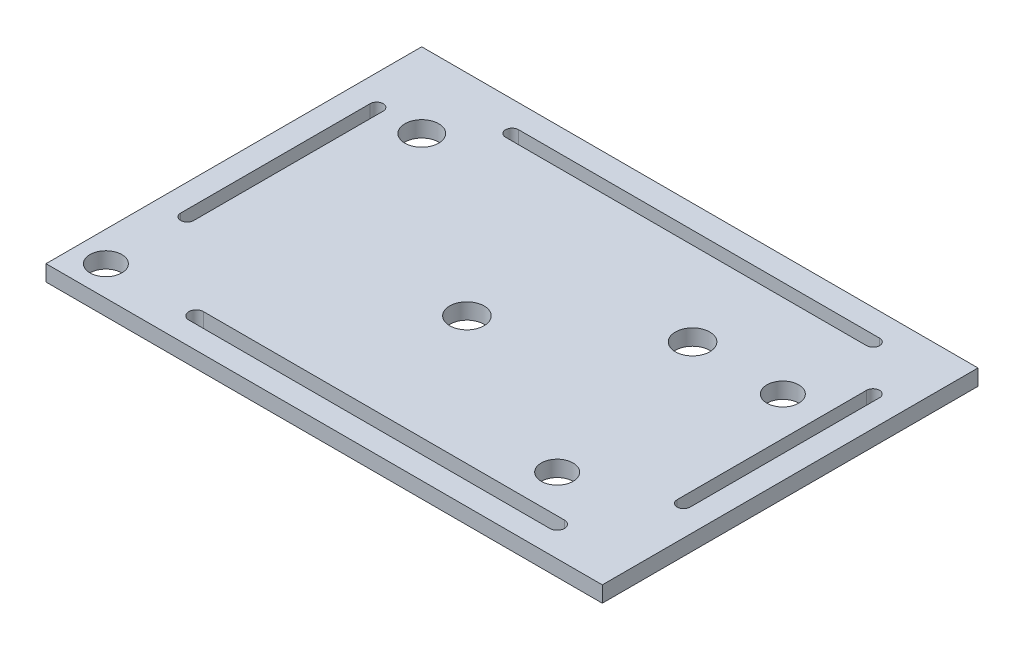
ISO-10303-21;
HEADER;
FILE_DESCRIPTION(('STEP AP214'),'2;1');
FILE_NAME('part.step','',(''),(''),'','','');
FILE_SCHEMA(('AUTOMOTIVE_DESIGN { 1 0 10303 214 1 1 1 1 }'));
ENDSEC;
DATA;
#1=APPLICATION_CONTEXT('core data for automotive mechanical design processes');
#2=APPLICATION_PROTOCOL_DEFINITION('international standard','automotive_design',2000,#1);
#3=PRODUCT_CONTEXT('',#1,'mechanical');
#4=PRODUCT('Part','Part','',(#3));
#5=PRODUCT_RELATED_PRODUCT_CATEGORY('part','',(#4));
#6=PRODUCT_DEFINITION_FORMATION('','',#4);
#7=PRODUCT_DEFINITION_CONTEXT('part definition',#1,'design');
#8=PRODUCT_DEFINITION('design','',#6,#7);
#9=PRODUCT_DEFINITION_SHAPE('','',#8);
#10=(LENGTH_UNIT() NAMED_UNIT(*) SI_UNIT(.MILLI.,.METRE.));
#11=(NAMED_UNIT(*) PLANE_ANGLE_UNIT() SI_UNIT($,.RADIAN.));
#12=(NAMED_UNIT(*) SI_UNIT($,.STERADIAN.) SOLID_ANGLE_UNIT());
#13=UNCERTAINTY_MEASURE_WITH_UNIT(LENGTH_MEASURE(1.E-05),#10,'distance_accuracy_value','');
#14=(GEOMETRIC_REPRESENTATION_CONTEXT(3) GLOBAL_UNCERTAINTY_ASSIGNED_CONTEXT((#13)) GLOBAL_UNIT_ASSIGNED_CONTEXT((#10,
#11,#12)) REPRESENTATION_CONTEXT('',''));
#15=CARTESIAN_POINT('',(0.,0.,0.));
#16=DIRECTION('',(0.,0.,1.));
#17=DIRECTION('',(1.,0.,0.));
#18=AXIS2_PLACEMENT_3D('',#15,#16,#17);
#19=CARTESIAN_POINT('',(-83.4547235584328,3.175,38.3581423669495));
#20=DIRECTION('',(1.,0.,0.));
#21=DIRECTION('',(0.,0.,-1.));
#22=AXIS2_PLACEMENT_3D('',#19,#20,#21);
#23=PLANE('',#22);
#24=DIRECTION('',(0.,0.,1.));
#25=VECTOR('',#24,1.);
#26=CARTESIAN_POINT('',(-83.4547235584328,0.,38.3581423669495));
#27=LINE('',#26,#25);
#28=CARTESIAN_POINT('',(-83.4547235584328,0.,-36.5609862748368));
#29=VERTEX_POINT('',#28);
#30=CARTESIAN_POINT('',(-83.4547235584328,0.,38.3581423669495));
#31=VERTEX_POINT('',#30);
#32=EDGE_CURVE('E362',#29,#31,#27,.T.);
#33=ORIENTED_EDGE('',*,*,#32,.T.);
#34=DIRECTION('',(0.,-1.,0.));
#35=VECTOR('',#34,1.);
#36=CARTESIAN_POINT('',(-83.4547235584328,3.175,38.3581423669495));
#37=LINE('',#36,#35);
#38=CARTESIAN_POINT('',(-83.4547235584328,3.175,38.3581423669495));
#39=VERTEX_POINT('',#38);
#40=EDGE_CURVE('E12',#39,#31,#37,.T.);
#41=ORIENTED_EDGE('',*,*,#40,.F.);
#42=DIRECTION('',(0.,0.,1.));
#43=VECTOR('',#42,1.);
#44=CARTESIAN_POINT('',(-83.4547235584328,3.175,38.3581423669495));
#45=LINE('',#44,#43);
#46=CARTESIAN_POINT('',(-83.4547235584328,3.175,-36.5609862748368));
#47=VERTEX_POINT('',#46);
#48=EDGE_CURVE('E365',#47,#39,#45,.T.);
#49=ORIENTED_EDGE('',*,*,#48,.F.);
#50=DIRECTION('',(0.,-1.,0.));
#51=VECTOR('',#50,1.);
#52=CARTESIAN_POINT('',(-83.4547235584328,3.175,-36.5609862748368));
#53=LINE('',#52,#51);
#54=EDGE_CURVE('E379',#47,#29,#53,.T.);
#55=ORIENTED_EDGE('',*,*,#54,.T.);
#56=EDGE_LOOP('',(#33,#41,#49,#55));
#57=FACE_BOUND('',#56,.T.);
#58=ADVANCED_FACE('F39',(#57),#23,.F.);
#59=CARTESIAN_POINT('',(27.4816050833534,3.175,38.3581423669495));
#60=DIRECTION('',(0.,0.,-1.));
#61=DIRECTION('',(-1.,0.,0.));
#62=AXIS2_PLACEMENT_3D('',#59,#60,#61);
#63=PLANE('',#62);
#64=DIRECTION('',(1.,0.,0.));
#65=VECTOR('',#64,1.);
#66=CARTESIAN_POINT('',(27.4816050833534,0.,38.3581423669495));
#67=LINE('',#66,#65);
#68=CARTESIAN_POINT('',(27.4816050833534,0.,38.3581423669495));
#69=VERTEX_POINT('',#68);
#70=EDGE_CURVE('E382',#31,#69,#67,.T.);
#71=ORIENTED_EDGE('',*,*,#70,.T.);
#72=DIRECTION('',(0.,-1.,0.));
#73=VECTOR('',#72,1.);
#74=CARTESIAN_POINT('',(27.4816050833534,3.175,38.3581423669495));
#75=LINE('',#74,#73);
#76=CARTESIAN_POINT('',(27.4816050833534,3.175,38.3581423669495));
#77=VERTEX_POINT('',#76);
#78=EDGE_CURVE('E46',#77,#69,#75,.T.);
#79=ORIENTED_EDGE('',*,*,#78,.F.);
#80=DIRECTION('',(1.,0.,0.));
#81=VECTOR('',#80,1.);
#82=CARTESIAN_POINT('',(27.4816050833534,3.175,38.3581423669495));
#83=LINE('',#82,#81);
#84=EDGE_CURVE('E369',#39,#77,#83,.T.);
#85=ORIENTED_EDGE('',*,*,#84,.F.);
#86=ORIENTED_EDGE('',*,*,#40,.T.);
#87=EDGE_LOOP('',(#71,#79,#85,#86));
#88=FACE_BOUND('',#87,.T.);
#89=ADVANCED_FACE('F411',(#88),#63,.F.);
#90=CARTESIAN_POINT('',(27.4816050833534,3.175,38.3581423669495));
#91=DIRECTION('',(-1.,0.,0.));
#92=DIRECTION('',(0.,0.,1.));
#93=AXIS2_PLACEMENT_3D('',#90,#91,#92);
#94=PLANE('',#93);
#95=DIRECTION('',(0.,0.,-1.));
#96=VECTOR('',#95,1.);
#97=CARTESIAN_POINT('',(27.4816050833534,0.,38.3581423669495));
#98=LINE('',#97,#96);
#99=CARTESIAN_POINT('',(27.4816050833534,0.,-36.5609862748368));
#100=VERTEX_POINT('',#99);
#101=EDGE_CURVE('E384',#69,#100,#98,.T.);
#102=ORIENTED_EDGE('',*,*,#101,.T.);
#103=DIRECTION('',(0.,-1.,0.));
#104=VECTOR('',#103,1.);
#105=CARTESIAN_POINT('',(27.4816050833534,3.175,-36.5609862748368));
#106=LINE('',#105,#104);
#107=CARTESIAN_POINT('',(27.4816050833534,3.175,-36.5609862748368));
#108=VERTEX_POINT('',#107);
#109=EDGE_CURVE('E389',#108,#100,#106,.T.);
#110=ORIENTED_EDGE('',*,*,#109,.F.);
#111=DIRECTION('',(0.,0.,-1.));
#112=VECTOR('',#111,1.);
#113=CARTESIAN_POINT('',(27.4816050833534,3.175,38.3581423669495));
#114=LINE('',#113,#112);
#115=EDGE_CURVE('E374',#77,#108,#114,.T.);
#116=ORIENTED_EDGE('',*,*,#115,.F.);
#117=ORIENTED_EDGE('',*,*,#78,.T.);
#118=EDGE_LOOP('',(#102,#110,#116,#117));
#119=FACE_BOUND('',#118,.T.);
#120=ADVANCED_FACE('F396',(#119),#94,.F.);
#121=CARTESIAN_POINT('',(27.4816050833534,3.175,-36.5609862748368));
#122=DIRECTION('',(0.,0.,1.));
#123=DIRECTION('',(1.,0.,0.));
#124=AXIS2_PLACEMENT_3D('',#121,#122,#123);
#125=PLANE('',#124);
#126=DIRECTION('',(-1.,0.,0.));
#127=VECTOR('',#126,1.);
#128=CARTESIAN_POINT('',(27.4816050833534,0.,-36.5609862748368));
#129=LINE('',#128,#127);
#130=EDGE_CURVE('E370',#100,#29,#129,.T.);
#131=ORIENTED_EDGE('',*,*,#130,.T.);
#132=ORIENTED_EDGE('',*,*,#54,.F.);
#133=DIRECTION('',(-1.,0.,0.));
#134=VECTOR('',#133,1.);
#135=CARTESIAN_POINT('',(27.4816050833534,3.175,-36.5609862748368));
#136=LINE('',#135,#134);
#137=EDGE_CURVE('E376',#108,#47,#136,.T.);
#138=ORIENTED_EDGE('',*,*,#137,.F.);
#139=ORIENTED_EDGE('',*,*,#109,.T.);
#140=EDGE_LOOP('',(#131,#132,#138,#139));
#141=FACE_BOUND('',#140,.T.);
#142=ADVANCED_FACE('F404',(#141),#125,.F.);
#143=CARTESIAN_POINT('',(0.,3.175,0.));
#144=DIRECTION('',(0.,1.,0.));
#145=DIRECTION('',(0.,0.,1.));
#146=AXIS2_PLACEMENT_3D('',#143,#144,#145);
#147=PLANE('',#146);
#148=CARTESIAN_POINT('',(-68.4741592375397,3.175,-21.6007419539436));
#149=DIRECTION('',(0.,1.,0.));
#150=DIRECTION('',(0.,0.,1.));
#151=AXIS2_PLACEMENT_3D('',#148,#149,#150);
#152=CIRCLE('',#151,3.3700793035933);
#153=CARTESIAN_POINT('',(-68.4741592375397,3.175,-18.2306626503503));
#154=VERTEX_POINT('',#153);
#155=EDGE_CURVE('E516',#154,#154,#152,.T.);
#156=ORIENTED_EDGE('',*,*,#155,.F.);
#157=EDGE_LOOP('',(#156));
#158=FACE_BOUND('',#157,.T.);
#159=CARTESIAN_POINT('',(-32.4772792375397,3.175,5.39691804605634));
#160=DIRECTION('',(0.,1.,0.));
#161=DIRECTION('',(0.,0.,1.));
#162=AXIS2_PLACEMENT_3D('',#159,#160,#161);
#163=CIRCLE('',#162,3.429);
#164=CARTESIAN_POINT('',(-32.4772792375397,3.175,8.82591804605634));
#165=VERTEX_POINT('',#164);
#166=EDGE_CURVE('E521',#165,#165,#163,.T.);
#167=ORIENTED_EDGE('',*,*,#166,.F.);
#168=EDGE_LOOP('',(#167));
#169=FACE_BOUND('',#168,.T.);
#170=CARTESIAN_POINT('',(-5.47961923753969,3.175,-12.6015219539437));
#171=DIRECTION('',(0.,1.,0.));
#172=DIRECTION('',(0.,0.,1.));
#173=AXIS2_PLACEMENT_3D('',#170,#171,#172);
#174=CIRCLE('',#173,3.429);
#175=CARTESIAN_POINT('',(-5.47961923753969,3.175,-9.17252195394369));
#176=VERTEX_POINT('',#175);
#177=EDGE_CURVE('E202',#176,#176,#174,.T.);
#178=ORIENTED_EDGE('',*,*,#177,.F.);
#179=EDGE_LOOP('',(#178));
#180=FACE_BOUND('',#179,.T.);
#181=CARTESIAN_POINT('',(-77.4733792375397,3.175,16.175423663261));
#182=DIRECTION('',(0.,1.,0.));
#183=DIRECTION('',(0.,0.,1.));
#184=AXIS2_PLACEMENT_3D('',#181,#182,#183);
#185=CIRCLE('',#184,1.29706207329394);
#186=CARTESIAN_POINT('',(-78.7704413108336,3.175,16.175423663261));
#187=VERTEX_POINT('',#186);
#188=CARTESIAN_POINT('',(-76.1763171642457,3.175,16.175423663261));
#189=VERTEX_POINT('',#188);
#190=EDGE_CURVE('E53',#187,#189,#185,.T.);
#191=ORIENTED_EDGE('',*,*,#190,.F.);
#192=DIRECTION('',(0.,0.,1.));
#193=VECTOR('',#192,1.);
#194=CARTESIAN_POINT('',(-78.7704413108336,3.175,16.175423663261));
#195=LINE('',#194,#193);
#196=CARTESIAN_POINT('',(-78.7704413108337,3.175,-21.6007419539436));
#197=VERTEX_POINT('',#196);
#198=EDGE_CURVE('E196',#197,#187,#195,.T.);
#199=ORIENTED_EDGE('',*,*,#198,.F.);
#200=CARTESIAN_POINT('',(-77.4733792375397,3.175,-21.6007419539436));
#201=DIRECTION('',(0.,1.,0.));
#202=DIRECTION('',(0.,0.,1.));
#203=AXIS2_PLACEMENT_3D('',#200,#201,#202);
#204=CIRCLE('',#203,1.29706207329394);
#205=CARTESIAN_POINT('',(-76.1763171642458,3.175,-21.6007419539436));
#206=VERTEX_POINT('',#205);
#207=EDGE_CURVE('E199',#206,#197,#204,.T.);
#208=ORIENTED_EDGE('',*,*,#207,.F.);
#209=DIRECTION('',(0.,0.,-1.));
#210=VECTOR('',#209,1.);
#211=CARTESIAN_POINT('',(-76.1763171642457,3.175,16.175423663261));
#212=LINE('',#211,#210);
#213=EDGE_CURVE('E210',#189,#206,#212,.T.);
#214=ORIENTED_EDGE('',*,*,#213,.F.);
#215=EDGE_LOOP('',(#191,#199,#208,#214));
#216=FACE_BOUND('',#215,.T.);
#217=CARTESIAN_POINT('',(-59.4749392375397,3.175,-30.5999619539437));
#218=DIRECTION('',(0.,1.,0.));
#219=DIRECTION('',(0.,0.,1.));
#220=AXIS2_PLACEMENT_3D('',#217,#218,#219);
#221=CIRCLE('',#220,1.29938042392028);
#222=CARTESIAN_POINT('',(-59.4749392375397,3.175,-31.8993423778639));
#223=VERTEX_POINT('',#222);
#224=CARTESIAN_POINT('',(-59.4749392375397,3.175,-29.3005815300234));
#225=VERTEX_POINT('',#224);
#226=EDGE_CURVE('E61',#223,#225,#221,.T.);
#227=ORIENTED_EDGE('',*,*,#226,.F.);
#228=DIRECTION('',(-1.,0.,0.));
#229=VECTOR('',#228,1.);
#230=CARTESIAN_POINT('',(-59.4749392375397,3.175,-31.8993423778639));
#231=LINE('',#230,#229);
#232=CARTESIAN_POINT('',(12.5188207624603,3.175,-31.899342377864));
#233=VERTEX_POINT('',#232);
#234=EDGE_CURVE('E233',#233,#223,#231,.T.);
#235=ORIENTED_EDGE('',*,*,#234,.F.);
#236=CARTESIAN_POINT('',(12.5188207624603,3.175,-30.5999619539437));
#237=DIRECTION('',(0.,1.,0.));
#238=DIRECTION('',(0.,0.,1.));
#239=AXIS2_PLACEMENT_3D('',#236,#237,#238);
#240=CIRCLE('',#239,1.29938042392027);
#241=CARTESIAN_POINT('',(12.5188207624603,3.175,-29.3005815300234));
#242=VERTEX_POINT('',#241);
#243=EDGE_CURVE('E257',#242,#233,#240,.T.);
#244=ORIENTED_EDGE('',*,*,#243,.F.);
#245=DIRECTION('',(1.,0.,0.));
#246=VECTOR('',#245,1.);
#247=CARTESIAN_POINT('',(-59.4749392375397,3.175,-29.3005815300234));
#248=LINE('',#247,#246);
#249=EDGE_CURVE('E245',#225,#242,#248,.T.);
#250=ORIENTED_EDGE('',*,*,#249,.F.);
#251=EDGE_LOOP('',(#227,#235,#244,#250));
#252=FACE_BOUND('',#251,.T.);
#253=CARTESIAN_POINT('',(12.5188207624603,3.175,32.3945780460563));
#254=DIRECTION('',(0.,1.,0.));
#255=DIRECTION('',(0.,0.,1.));
#256=AXIS2_PLACEMENT_3D('',#253,#254,#255);
#257=CIRCLE('',#256,1.45796750771068);
#258=CARTESIAN_POINT('',(12.5188207624603,3.175,33.852545553767));
#259=VERTEX_POINT('',#258);
#260=CARTESIAN_POINT('',(12.5188207624603,3.175,30.9366105383456));
#261=VERTEX_POINT('',#260);
#262=EDGE_CURVE('E279',#259,#261,#257,.T.);
#263=ORIENTED_EDGE('',*,*,#262,.F.);
#264=DIRECTION('',(1.,0.,0.));
#265=VECTOR('',#264,1.);
#266=CARTESIAN_POINT('',(12.5188207624603,3.175,33.852545553767));
#267=LINE('',#266,#265);
#268=CARTESIAN_POINT('',(-59.4749392375397,3.175,33.852545553767));
#269=VERTEX_POINT('',#268);
#270=EDGE_CURVE('E269',#269,#259,#267,.T.);
#271=ORIENTED_EDGE('',*,*,#270,.F.);
#272=CARTESIAN_POINT('',(-59.4749392375397,3.175,32.3945780460564));
#273=DIRECTION('',(0.,1.,0.));
#274=DIRECTION('',(0.,0.,1.));
#275=AXIS2_PLACEMENT_3D('',#272,#273,#274);
#276=CIRCLE('',#275,1.45796750771068);
#277=CARTESIAN_POINT('',(-59.4749392375397,3.175,30.9366105383457));
#278=VERTEX_POINT('',#277);
#279=EDGE_CURVE('E294',#278,#269,#276,.T.);
#280=ORIENTED_EDGE('',*,*,#279,.F.);
#281=DIRECTION('',(-1.,0.,0.));
#282=VECTOR('',#281,1.);
#283=CARTESIAN_POINT('',(12.5188207624603,3.175,30.9366105383456));
#284=LINE('',#283,#282);
#285=EDGE_CURVE('E282',#261,#278,#284,.T.);
#286=ORIENTED_EDGE('',*,*,#285,.F.);
#287=EDGE_LOOP('',(#263,#271,#280,#286));
#288=FACE_BOUND('',#287,.T.);
#289=CARTESIAN_POINT('',(21.5180407624603,3.175,16.175423663261));
#290=DIRECTION('',(0.,1.,0.));
#291=DIRECTION('',(0.,0.,1.));
#292=AXIS2_PLACEMENT_3D('',#289,#290,#291);
#293=CIRCLE('',#292,1.29162681993463);
#294=CARTESIAN_POINT('',(20.2264139425257,3.175,16.175423663261));
#295=VERTEX_POINT('',#294);
#296=CARTESIAN_POINT('',(22.809667582395,3.175,16.175423663261));
#297=VERTEX_POINT('',#296);
#298=EDGE_CURVE('E317',#295,#297,#293,.T.);
#299=ORIENTED_EDGE('',*,*,#298,.F.);
#300=DIRECTION('',(0.,0.,1.));
#301=VECTOR('',#300,1.);
#302=CARTESIAN_POINT('',(20.2264139425257,3.175,16.175423663261));
#303=LINE('',#302,#301);
#304=CARTESIAN_POINT('',(20.2264139425257,3.175,-21.6007419539437));
#305=VERTEX_POINT('',#304);
#306=EDGE_CURVE('E307',#305,#295,#303,.T.);
#307=ORIENTED_EDGE('',*,*,#306,.F.);
#308=CARTESIAN_POINT('',(21.5180407624603,3.175,-21.6007419539437));
#309=DIRECTION('',(0.,1.,0.));
#310=DIRECTION('',(0.,0.,1.));
#311=AXIS2_PLACEMENT_3D('',#308,#309,#310);
#312=CIRCLE('',#311,1.29162681993463);
#313=CARTESIAN_POINT('',(22.8096675823949,3.175,-21.6007419539437));
#314=VERTEX_POINT('',#313);
#315=EDGE_CURVE('E332',#314,#305,#312,.T.);
#316=ORIENTED_EDGE('',*,*,#315,.F.);
#317=DIRECTION('',(0.,0.,-1.));
#318=VECTOR('',#317,1.);
#319=CARTESIAN_POINT('',(22.809667582395,3.175,16.175423663261));
#320=LINE('',#319,#318);
#321=EDGE_CURVE('E320',#297,#314,#320,.T.);
#322=ORIENTED_EDGE('',*,*,#321,.F.);
#323=EDGE_LOOP('',(#299,#307,#316,#322));
#324=FACE_BOUND('',#323,.T.);
#325=CARTESIAN_POINT('',(12.5188207624603,3.175,-12.6015219539437));
#326=DIRECTION('',(0.,1.,0.));
#327=DIRECTION('',(0.,0.,1.));
#328=AXIS2_PLACEMENT_3D('',#325,#326,#327);
#329=CIRCLE('',#328,3.175);
#330=CARTESIAN_POINT('',(12.5188207624603,3.175,-9.4265219539437));
#331=VERTEX_POINT('',#330);
#332=EDGE_CURVE('E345',#331,#331,#329,.T.);
#333=ORIENTED_EDGE('',*,*,#332,.F.);
#334=EDGE_LOOP('',(#333));
#335=FACE_BOUND('',#334,.T.);
#336=CARTESIAN_POINT('',(3.51960076246033,3.175,23.3953580460563));
#337=DIRECTION('',(0.,1.,0.));
#338=DIRECTION('',(0.,0.,1.));
#339=AXIS2_PLACEMENT_3D('',#336,#337,#338);
#340=CIRCLE('',#339,3.175);
#341=CARTESIAN_POINT('',(3.51960076246033,3.175,26.5703580460563));
#342=VERTEX_POINT('',#341);
#343=EDGE_CURVE('E225',#342,#342,#340,.T.);
#344=ORIENTED_EDGE('',*,*,#343,.F.);
#345=EDGE_LOOP('',(#344));
#346=FACE_BOUND('',#345,.T.);
#347=CARTESIAN_POINT('',(-77.4733792375397,3.175,32.3945780460563));
#348=DIRECTION('',(0.,-1.,0.));
#349=DIRECTION('',(0.,0.,-1.));
#350=AXIS2_PLACEMENT_3D('',#347,#348,#349);
#351=CIRCLE('',#350,3.175);
#352=CARTESIAN_POINT('',(-77.4733792375397,3.175,29.2195780460563));
#353=VERTEX_POINT('',#352);
#354=EDGE_CURVE('E358',#353,#353,#351,.T.);
#355=ORIENTED_EDGE('',*,*,#354,.T.);
#356=EDGE_LOOP('',(#355));
#357=FACE_BOUND('',#356,.T.);
#358=ORIENTED_EDGE('',*,*,#48,.T.);
#359=ORIENTED_EDGE('',*,*,#84,.T.);
#360=ORIENTED_EDGE('',*,*,#115,.T.);
#361=ORIENTED_EDGE('',*,*,#137,.T.);
#362=EDGE_LOOP('',(#358,#359,#360,#361));
#363=FACE_BOUND('',#362,.T.);
#364=ADVANCED_FACE('F410',(#158,#169,#180,#216,#252,#288,#324,#335,#346,#357,#363),#147,.T.);
#365=CARTESIAN_POINT('',(0.,0.,0.));
#366=DIRECTION('',(0.,1.,0.));
#367=DIRECTION('',(0.,0.,1.));
#368=AXIS2_PLACEMENT_3D('',#365,#366,#367);
#369=PLANE('',#368);
#370=CARTESIAN_POINT('',(-68.4741592375397,0.,-21.6007419539436));
#371=DIRECTION('',(0.,1.,0.));
#372=DIRECTION('',(0.,0.,1.));
#373=AXIS2_PLACEMENT_3D('',#370,#371,#372);
#374=CIRCLE('',#373,3.3700793035933);
#375=CARTESIAN_POINT('',(-68.4741592375397,0.,-18.2306626503503));
#376=VERTEX_POINT('',#375);
#377=EDGE_CURVE('E321',#376,#376,#374,.T.);
#378=ORIENTED_EDGE('',*,*,#377,.T.);
#379=EDGE_LOOP('',(#378));
#380=FACE_BOUND('',#379,.T.);
#381=CARTESIAN_POINT('',(-32.4772792375397,0.,5.39691804605634));
#382=DIRECTION('',(0.,1.,0.));
#383=DIRECTION('',(0.,0.,1.));
#384=AXIS2_PLACEMENT_3D('',#381,#382,#383);
#385=CIRCLE('',#384,3.429);
#386=CARTESIAN_POINT('',(-32.4772792375397,0.,8.82591804605634));
#387=VERTEX_POINT('',#386);
#388=EDGE_CURVE('E517',#387,#387,#385,.T.);
#389=ORIENTED_EDGE('',*,*,#388,.T.);
#390=EDGE_LOOP('',(#389));
#391=FACE_BOUND('',#390,.T.);
#392=CARTESIAN_POINT('',(-5.47961923753969,0.,-12.6015219539437));
#393=DIRECTION('',(0.,1.,0.));
#394=DIRECTION('',(0.,0.,1.));
#395=AXIS2_PLACEMENT_3D('',#392,#393,#394);
#396=CIRCLE('',#395,3.429);
#397=CARTESIAN_POINT('',(-5.47961923753969,0.,-9.17252195394369));
#398=VERTEX_POINT('',#397);
#399=EDGE_CURVE('E528',#398,#398,#396,.T.);
#400=ORIENTED_EDGE('',*,*,#399,.T.);
#401=EDGE_LOOP('',(#400));
#402=FACE_BOUND('',#401,.T.);
#403=DIRECTION('',(0.,0.,1.));
#404=VECTOR('',#403,1.);
#405=CARTESIAN_POINT('',(-78.7704413108336,0.,16.175423663261));
#406=LINE('',#405,#404);
#407=CARTESIAN_POINT('',(-78.7704413108337,0.,-21.6007419539436));
#408=VERTEX_POINT('',#407);
#409=CARTESIAN_POINT('',(-78.7704413108336,0.,16.175423663261));
#410=VERTEX_POINT('',#409);
#411=EDGE_CURVE('E183',#408,#410,#406,.T.);
#412=ORIENTED_EDGE('',*,*,#411,.T.);
#413=CARTESIAN_POINT('',(-77.4733792375397,0.,16.175423663261));
#414=DIRECTION('',(0.,1.,0.));
#415=DIRECTION('',(0.,0.,1.));
#416=AXIS2_PLACEMENT_3D('',#413,#414,#415);
#417=CIRCLE('',#416,1.29706207329394);
#418=CARTESIAN_POINT('',(-76.1763171642457,0.,16.175423663261));
#419=VERTEX_POINT('',#418);
#420=EDGE_CURVE('E177',#410,#419,#417,.T.);
#421=ORIENTED_EDGE('',*,*,#420,.T.);
#422=DIRECTION('',(0.,0.,-1.));
#423=VECTOR('',#422,1.);
#424=CARTESIAN_POINT('',(-76.1763171642457,0.,16.175423663261));
#425=LINE('',#424,#423);
#426=CARTESIAN_POINT('',(-76.1763171642458,0.,-21.6007419539436));
#427=VERTEX_POINT('',#426);
#428=EDGE_CURVE('E187',#419,#427,#425,.T.);
#429=ORIENTED_EDGE('',*,*,#428,.T.);
#430=CARTESIAN_POINT('',(-77.4733792375397,0.,-21.6007419539436));
#431=DIRECTION('',(0.,1.,0.));
#432=DIRECTION('',(0.,0.,1.));
#433=AXIS2_PLACEMENT_3D('',#430,#431,#432);
#434=CIRCLE('',#433,1.29706207329394);
#435=EDGE_CURVE('E191',#427,#408,#434,.T.);
#436=ORIENTED_EDGE('',*,*,#435,.T.);
#437=EDGE_LOOP('',(#412,#421,#429,#436));
#438=FACE_BOUND('',#437,.T.);
#439=DIRECTION('',(-1.,0.,0.));
#440=VECTOR('',#439,1.);
#441=CARTESIAN_POINT('',(-59.4749392375397,0.,-31.8993423778639));
#442=LINE('',#441,#440);
#443=CARTESIAN_POINT('',(12.5188207624603,0.,-31.899342377864));
#444=VERTEX_POINT('',#443);
#445=CARTESIAN_POINT('',(-59.4749392375397,0.,-31.8993423778639));
#446=VERTEX_POINT('',#445);
#447=EDGE_CURVE('E239',#444,#446,#442,.T.);
#448=ORIENTED_EDGE('',*,*,#447,.T.);
#449=CARTESIAN_POINT('',(-59.4749392375397,0.,-30.5999619539437));
#450=DIRECTION('',(0.,1.,0.));
#451=DIRECTION('',(0.,0.,1.));
#452=AXIS2_PLACEMENT_3D('',#449,#450,#451);
#453=CIRCLE('',#452,1.29938042392028);
#454=CARTESIAN_POINT('',(-59.4749392375397,0.,-29.3005815300234));
#455=VERTEX_POINT('',#454);
#456=EDGE_CURVE('E229',#446,#455,#453,.T.);
#457=ORIENTED_EDGE('',*,*,#456,.T.);
#458=DIRECTION('',(1.,0.,0.));
#459=VECTOR('',#458,1.);
#460=CARTESIAN_POINT('',(-59.4749392375397,0.,-29.3005815300234));
#461=LINE('',#460,#459);
#462=CARTESIAN_POINT('',(12.5188207624603,0.,-29.3005815300234));
#463=VERTEX_POINT('',#462);
#464=EDGE_CURVE('E232',#455,#463,#461,.T.);
#465=ORIENTED_EDGE('',*,*,#464,.T.);
#466=CARTESIAN_POINT('',(12.5188207624603,0.,-30.5999619539437));
#467=DIRECTION('',(0.,1.,0.));
#468=DIRECTION('',(0.,0.,1.));
#469=AXIS2_PLACEMENT_3D('',#466,#467,#468);
#470=CIRCLE('',#469,1.29938042392027);
#471=EDGE_CURVE('E236',#463,#444,#470,.T.);
#472=ORIENTED_EDGE('',*,*,#471,.T.);
#473=EDGE_LOOP('',(#448,#457,#465,#472));
#474=FACE_BOUND('',#473,.T.);
#475=DIRECTION('',(1.,0.,0.));
#476=VECTOR('',#475,1.);
#477=CARTESIAN_POINT('',(12.5188207624603,0.,33.852545553767));
#478=LINE('',#477,#476);
#479=CARTESIAN_POINT('',(-59.4749392375397,0.,33.852545553767));
#480=VERTEX_POINT('',#479);
#481=CARTESIAN_POINT('',(12.5188207624603,0.,33.852545553767));
#482=VERTEX_POINT('',#481);
#483=EDGE_CURVE('E275',#480,#482,#478,.T.);
#484=ORIENTED_EDGE('',*,*,#483,.T.);
#485=CARTESIAN_POINT('',(12.5188207624603,0.,32.3945780460563));
#486=DIRECTION('',(0.,1.,0.));
#487=DIRECTION('',(0.,0.,1.));
#488=AXIS2_PLACEMENT_3D('',#485,#486,#487);
#489=CIRCLE('',#488,1.45796750771068);
#490=CARTESIAN_POINT('',(12.5188207624603,0.,30.9366105383456));
#491=VERTEX_POINT('',#490);
#492=EDGE_CURVE('E265',#482,#491,#489,.T.);
#493=ORIENTED_EDGE('',*,*,#492,.T.);
#494=DIRECTION('',(-1.,0.,0.));
#495=VECTOR('',#494,1.);
#496=CARTESIAN_POINT('',(12.5188207624603,0.,30.9366105383456));
#497=LINE('',#496,#495);
#498=CARTESIAN_POINT('',(-59.4749392375397,0.,30.9366105383457));
#499=VERTEX_POINT('',#498);
#500=EDGE_CURVE('E268',#491,#499,#497,.T.);
#501=ORIENTED_EDGE('',*,*,#500,.T.);
#502=CARTESIAN_POINT('',(-59.4749392375397,0.,32.3945780460564));
#503=DIRECTION('',(0.,1.,0.));
#504=DIRECTION('',(0.,0.,1.));
#505=AXIS2_PLACEMENT_3D('',#502,#503,#504);
#506=CIRCLE('',#505,1.45796750771068);
#507=EDGE_CURVE('E272',#499,#480,#506,.T.);
#508=ORIENTED_EDGE('',*,*,#507,.T.);
#509=EDGE_LOOP('',(#484,#493,#501,#508));
#510=FACE_BOUND('',#509,.T.);
#511=DIRECTION('',(0.,0.,1.));
#512=VECTOR('',#511,1.);
#513=CARTESIAN_POINT('',(20.2264139425257,0.,16.175423663261));
#514=LINE('',#513,#512);
#515=CARTESIAN_POINT('',(20.2264139425257,0.,-21.6007419539437));
#516=VERTEX_POINT('',#515);
#517=CARTESIAN_POINT('',(20.2264139425257,0.,16.175423663261));
#518=VERTEX_POINT('',#517);
#519=EDGE_CURVE('E313',#516,#518,#514,.T.);
#520=ORIENTED_EDGE('',*,*,#519,.T.);
#521=CARTESIAN_POINT('',(21.5180407624603,0.,16.175423663261));
#522=DIRECTION('',(0.,1.,0.));
#523=DIRECTION('',(0.,0.,1.));
#524=AXIS2_PLACEMENT_3D('',#521,#522,#523);
#525=CIRCLE('',#524,1.29162681993463);
#526=CARTESIAN_POINT('',(22.809667582395,0.,16.175423663261));
#527=VERTEX_POINT('',#526);
#528=EDGE_CURVE('E303',#518,#527,#525,.T.);
#529=ORIENTED_EDGE('',*,*,#528,.T.);
#530=DIRECTION('',(0.,0.,-1.));
#531=VECTOR('',#530,1.);
#532=CARTESIAN_POINT('',(22.809667582395,0.,16.175423663261));
#533=LINE('',#532,#531);
#534=CARTESIAN_POINT('',(22.8096675823949,0.,-21.6007419539437));
#535=VERTEX_POINT('',#534);
#536=EDGE_CURVE('E306',#527,#535,#533,.T.);
#537=ORIENTED_EDGE('',*,*,#536,.T.);
#538=CARTESIAN_POINT('',(21.5180407624603,0.,-21.6007419539437));
#539=DIRECTION('',(0.,1.,0.));
#540=DIRECTION('',(0.,0.,1.));
#541=AXIS2_PLACEMENT_3D('',#538,#539,#540);
#542=CIRCLE('',#541,1.29162681993463);
#543=EDGE_CURVE('E310',#535,#516,#542,.T.);
#544=ORIENTED_EDGE('',*,*,#543,.T.);
#545=EDGE_LOOP('',(#520,#529,#537,#544));
#546=FACE_BOUND('',#545,.T.);
#547=CARTESIAN_POINT('',(12.5188207624603,0.,-12.6015219539437));
#548=DIRECTION('',(0.,1.,0.));
#549=DIRECTION('',(0.,0.,1.));
#550=AXIS2_PLACEMENT_3D('',#547,#548,#549);
#551=CIRCLE('',#550,3.175);
#552=CARTESIAN_POINT('',(12.5188207624603,0.,-9.4265219539437));
#553=VERTEX_POINT('',#552);
#554=EDGE_CURVE('E341',#553,#553,#551,.T.);
#555=ORIENTED_EDGE('',*,*,#554,.T.);
#556=EDGE_LOOP('',(#555));
#557=FACE_BOUND('',#556,.T.);
#558=CARTESIAN_POINT('',(3.51960076246033,0.,23.3953580460563));
#559=DIRECTION('',(0.,1.,0.));
#560=DIRECTION('',(0.,0.,1.));
#561=AXIS2_PLACEMENT_3D('',#558,#559,#560);
#562=CIRCLE('',#561,3.175);
#563=CARTESIAN_POINT('',(3.51960076246033,0.,26.5703580460563));
#564=VERTEX_POINT('',#563);
#565=EDGE_CURVE('E349',#564,#564,#562,.T.);
#566=ORIENTED_EDGE('',*,*,#565,.T.);
#567=EDGE_LOOP('',(#566));
#568=FACE_BOUND('',#567,.T.);
#569=CARTESIAN_POINT('',(-77.4733792375397,0.,32.3945780460563));
#570=DIRECTION('',(0.,-1.,0.));
#571=DIRECTION('',(0.,0.,-1.));
#572=AXIS2_PLACEMENT_3D('',#569,#570,#571);
#573=CIRCLE('',#572,3.175);
#574=CARTESIAN_POINT('',(-77.4733792375397,0.,29.2195780460563));
#575=VERTEX_POINT('',#574);
#576=EDGE_CURVE('E344',#575,#575,#573,.T.);
#577=ORIENTED_EDGE('',*,*,#576,.F.);
#578=EDGE_LOOP('',(#577));
#579=FACE_BOUND('',#578,.T.);
#580=ORIENTED_EDGE('',*,*,#32,.F.);
#581=ORIENTED_EDGE('',*,*,#130,.F.);
#582=ORIENTED_EDGE('',*,*,#101,.F.);
#583=ORIENTED_EDGE('',*,*,#70,.F.);
#584=EDGE_LOOP('',(#580,#581,#582,#583));
#585=FACE_BOUND('',#584,.T.);
#586=ADVANCED_FACE('F193',(#380,#391,#402,#438,#474,#510,#546,#557,#568,#579,#585),#369,.F.);
#587=CARTESIAN_POINT('',(-77.4733792375397,3.175,32.3945780460563));
#588=DIRECTION('',(0.,-1.,0.));
#589=DIRECTION('',(0.,0.,-1.));
#590=AXIS2_PLACEMENT_3D('',#587,#588,#589);
#591=CYLINDRICAL_SURFACE('',#590,3.175);
#592=ORIENTED_EDGE('',*,*,#354,.F.);
#593=EDGE_LOOP('',(#592));
#594=FACE_BOUND('',#593,.T.);
#595=ORIENTED_EDGE('',*,*,#576,.T.);
#596=EDGE_LOOP('',(#595));
#597=FACE_BOUND('',#596,.T.);
#598=ADVANCED_FACE('F423',(#594,#597),#591,.F.);
#599=CARTESIAN_POINT('',(3.51960076246033,0.,23.3953580460563));
#600=DIRECTION('',(0.,1.,0.));
#601=DIRECTION('',(0.,0.,1.));
#602=AXIS2_PLACEMENT_3D('',#599,#600,#601);
#603=CYLINDRICAL_SURFACE('',#602,3.175);
#604=ORIENTED_EDGE('',*,*,#565,.F.);
#605=EDGE_LOOP('',(#604));
#606=FACE_BOUND('',#605,.T.);
#607=ORIENTED_EDGE('',*,*,#343,.T.);
#608=EDGE_LOOP('',(#607));
#609=FACE_BOUND('',#608,.T.);
#610=ADVANCED_FACE('F430',(#606,#609),#603,.F.);
#611=CARTESIAN_POINT('',(12.5188207624603,0.,-12.6015219539437));
#612=DIRECTION('',(0.,1.,0.));
#613=DIRECTION('',(0.,0.,1.));
#614=AXIS2_PLACEMENT_3D('',#611,#612,#613);
#615=CYLINDRICAL_SURFACE('',#614,3.175);
#616=ORIENTED_EDGE('',*,*,#554,.F.);
#617=EDGE_LOOP('',(#616));
#618=FACE_BOUND('',#617,.T.);
#619=ORIENTED_EDGE('',*,*,#332,.T.);
#620=EDGE_LOOP('',(#619));
#621=FACE_BOUND('',#620,.T.);
#622=ADVANCED_FACE('F434',(#618,#621),#615,.F.);
#623=CARTESIAN_POINT('',(21.5180407624603,0.,16.175423663261));
#624=DIRECTION('',(0.,1.,0.));
#625=DIRECTION('',(0.,0.,1.));
#626=AXIS2_PLACEMENT_3D('',#623,#624,#625);
#627=CYLINDRICAL_SURFACE('',#626,1.29162681993463);
#628=ORIENTED_EDGE('',*,*,#298,.T.);
#629=DIRECTION('',(0.,1.,0.));
#630=VECTOR('',#629,1.);
#631=CARTESIAN_POINT('',(22.809667582395,0.,16.175423663261));
#632=LINE('',#631,#630);
#633=EDGE_CURVE('E316',#527,#297,#632,.T.);
#634=ORIENTED_EDGE('',*,*,#633,.F.);
#635=ORIENTED_EDGE('',*,*,#528,.F.);
#636=DIRECTION('',(0.,1.,0.));
#637=VECTOR('',#636,1.);
#638=CARTESIAN_POINT('',(20.2264139425257,0.,16.175423663261));
#639=LINE('',#638,#637);
#640=EDGE_CURVE('E283',#518,#295,#639,.T.);
#641=ORIENTED_EDGE('',*,*,#640,.T.);
#642=EDGE_LOOP('',(#628,#634,#635,#641));
#643=FACE_BOUND('',#642,.T.);
#644=ADVANCED_FACE('F438',(#643),#627,.F.);
#645=CARTESIAN_POINT('',(20.2264139425257,0.,16.175423663261));
#646=DIRECTION('',(-1.,0.,0.));
#647=DIRECTION('',(0.,0.,1.));
#648=AXIS2_PLACEMENT_3D('',#645,#646,#647);
#649=PLANE('',#648);
#650=ORIENTED_EDGE('',*,*,#306,.T.);
#651=ORIENTED_EDGE('',*,*,#640,.F.);
#652=ORIENTED_EDGE('',*,*,#519,.F.);
#653=DIRECTION('',(0.,1.,0.));
#654=VECTOR('',#653,1.);
#655=CARTESIAN_POINT('',(20.2264139425257,0.,-21.6007419539437));
#656=LINE('',#655,#654);
#657=EDGE_CURVE('E335',#516,#305,#656,.T.);
#658=ORIENTED_EDGE('',*,*,#657,.T.);
#659=EDGE_LOOP('',(#650,#651,#652,#658));
#660=FACE_BOUND('',#659,.T.);
#661=ADVANCED_FACE('F442',(#660),#649,.F.);
#662=CARTESIAN_POINT('',(21.5180407624603,0.,-21.6007419539437));
#663=DIRECTION('',(0.,1.,0.));
#664=DIRECTION('',(0.,0.,1.));
#665=AXIS2_PLACEMENT_3D('',#662,#663,#664);
#666=CYLINDRICAL_SURFACE('',#665,1.29162681993463);
#667=ORIENTED_EDGE('',*,*,#315,.T.);
#668=ORIENTED_EDGE('',*,*,#657,.F.);
#669=ORIENTED_EDGE('',*,*,#543,.F.);
#670=DIRECTION('',(0.,1.,0.));
#671=VECTOR('',#670,1.);
#672=CARTESIAN_POINT('',(22.8096675823949,0.,-21.6007419539437));
#673=LINE('',#672,#671);
#674=EDGE_CURVE('E337',#535,#314,#673,.T.);
#675=ORIENTED_EDGE('',*,*,#674,.T.);
#676=EDGE_LOOP('',(#667,#668,#669,#675));
#677=FACE_BOUND('',#676,.T.);
#678=ADVANCED_FACE('F448',(#677),#666,.F.);
#679=CARTESIAN_POINT('',(22.809667582395,0.,16.175423663261));
#680=DIRECTION('',(1.,0.,0.));
#681=DIRECTION('',(0.,0.,-1.));
#682=AXIS2_PLACEMENT_3D('',#679,#680,#681);
#683=PLANE('',#682);
#684=ORIENTED_EDGE('',*,*,#321,.T.);
#685=ORIENTED_EDGE('',*,*,#674,.F.);
#686=ORIENTED_EDGE('',*,*,#536,.F.);
#687=ORIENTED_EDGE('',*,*,#633,.T.);
#688=EDGE_LOOP('',(#684,#685,#686,#687));
#689=FACE_BOUND('',#688,.T.);
#690=ADVANCED_FACE('F444',(#689),#683,.F.);
#691=CARTESIAN_POINT('',(12.5188207624603,0.,32.3945780460563));
#692=DIRECTION('',(0.,1.,0.));
#693=DIRECTION('',(0.,0.,1.));
#694=AXIS2_PLACEMENT_3D('',#691,#692,#693);
#695=CYLINDRICAL_SURFACE('',#694,1.45796750771068);
#696=ORIENTED_EDGE('',*,*,#262,.T.);
#697=DIRECTION('',(0.,1.,0.));
#698=VECTOR('',#697,1.);
#699=CARTESIAN_POINT('',(12.5188207624603,0.,30.9366105383456));
#700=LINE('',#699,#698);
#701=EDGE_CURVE('E278',#491,#261,#700,.T.);
#702=ORIENTED_EDGE('',*,*,#701,.F.);
#703=ORIENTED_EDGE('',*,*,#492,.F.);
#704=DIRECTION('',(0.,1.,0.));
#705=VECTOR('',#704,1.);
#706=CARTESIAN_POINT('',(12.5188207624603,0.,33.852545553767));
#707=LINE('',#706,#705);
#708=EDGE_CURVE('E246',#482,#259,#707,.T.);
#709=ORIENTED_EDGE('',*,*,#708,.T.);
#710=EDGE_LOOP('',(#696,#702,#703,#709));
#711=FACE_BOUND('',#710,.T.);
#712=ADVANCED_FACE('F447',(#711),#695,.F.);
#713=CARTESIAN_POINT('',(12.5188207624603,0.,33.852545553767));
#714=DIRECTION('',(0.,0.,1.));
#715=DIRECTION('',(1.,0.,0.));
#716=AXIS2_PLACEMENT_3D('',#713,#714,#715);
#717=PLANE('',#716);
#718=ORIENTED_EDGE('',*,*,#270,.T.);
#719=ORIENTED_EDGE('',*,*,#708,.F.);
#720=ORIENTED_EDGE('',*,*,#483,.F.);
#721=DIRECTION('',(0.,1.,0.));
#722=VECTOR('',#721,1.);
#723=CARTESIAN_POINT('',(-59.4749392375397,0.,33.852545553767));
#724=LINE('',#723,#722);
#725=EDGE_CURVE('E297',#480,#269,#724,.T.);
#726=ORIENTED_EDGE('',*,*,#725,.T.);
#727=EDGE_LOOP('',(#718,#719,#720,#726));
#728=FACE_BOUND('',#727,.T.);
#729=ADVANCED_FACE('F458',(#728),#717,.F.);
#730=CARTESIAN_POINT('',(-59.4749392375397,0.,32.3945780460564));
#731=DIRECTION('',(0.,1.,0.));
#732=DIRECTION('',(0.,0.,1.));
#733=AXIS2_PLACEMENT_3D('',#730,#731,#732);
#734=CYLINDRICAL_SURFACE('',#733,1.45796750771068);
#735=ORIENTED_EDGE('',*,*,#279,.T.);
#736=ORIENTED_EDGE('',*,*,#725,.F.);
#737=ORIENTED_EDGE('',*,*,#507,.F.);
#738=DIRECTION('',(0.,1.,0.));
#739=VECTOR('',#738,1.);
#740=CARTESIAN_POINT('',(-59.4749392375397,0.,30.9366105383457));
#741=LINE('',#740,#739);
#742=EDGE_CURVE('E299',#499,#278,#741,.T.);
#743=ORIENTED_EDGE('',*,*,#742,.T.);
#744=EDGE_LOOP('',(#735,#736,#737,#743));
#745=FACE_BOUND('',#744,.T.);
#746=ADVANCED_FACE('F464',(#745),#734,.F.);
#747=CARTESIAN_POINT('',(12.5188207624603,0.,30.9366105383456));
#748=DIRECTION('',(0.,0.,-1.));
#749=DIRECTION('',(-1.,0.,0.));
#750=AXIS2_PLACEMENT_3D('',#747,#748,#749);
#751=PLANE('',#750);
#752=ORIENTED_EDGE('',*,*,#285,.T.);
#753=ORIENTED_EDGE('',*,*,#742,.F.);
#754=ORIENTED_EDGE('',*,*,#500,.F.);
#755=ORIENTED_EDGE('',*,*,#701,.T.);
#756=EDGE_LOOP('',(#752,#753,#754,#755));
#757=FACE_BOUND('',#756,.T.);
#758=ADVANCED_FACE('F460',(#757),#751,.F.);
#759=CARTESIAN_POINT('',(-59.4749392375397,0.,-30.5999619539437));
#760=DIRECTION('',(0.,1.,0.));
#761=DIRECTION('',(0.,0.,1.));
#762=AXIS2_PLACEMENT_3D('',#759,#760,#761);
#763=CYLINDRICAL_SURFACE('',#762,1.29938042392028);
#764=ORIENTED_EDGE('',*,*,#226,.T.);
#765=DIRECTION('',(0.,1.,0.));
#766=VECTOR('',#765,1.);
#767=CARTESIAN_POINT('',(-59.4749392375397,0.,-29.3005815300234));
#768=LINE('',#767,#766);
#769=EDGE_CURVE('E242',#455,#225,#768,.T.);
#770=ORIENTED_EDGE('',*,*,#769,.F.);
#771=ORIENTED_EDGE('',*,*,#456,.F.);
#772=DIRECTION('',(0.,1.,0.));
#773=VECTOR('',#772,1.);
#774=CARTESIAN_POINT('',(-59.4749392375397,0.,-31.8993423778639));
#775=LINE('',#774,#773);
#776=EDGE_CURVE('E211',#446,#223,#775,.T.);
#777=ORIENTED_EDGE('',*,*,#776,.T.);
#778=EDGE_LOOP('',(#764,#770,#771,#777));
#779=FACE_BOUND('',#778,.T.);
#780=ADVANCED_FACE('F463',(#779),#763,.F.);
#781=CARTESIAN_POINT('',(-59.4749392375397,0.,-31.8993423778639));
#782=DIRECTION('',(0.,0.,-1.));
#783=DIRECTION('',(-1.,0.,0.));
#784=AXIS2_PLACEMENT_3D('',#781,#782,#783);
#785=PLANE('',#784);
#786=ORIENTED_EDGE('',*,*,#234,.T.);
#787=ORIENTED_EDGE('',*,*,#776,.F.);
#788=ORIENTED_EDGE('',*,*,#447,.F.);
#789=DIRECTION('',(0.,1.,0.));
#790=VECTOR('',#789,1.);
#791=CARTESIAN_POINT('',(12.5188207624603,0.,-31.899342377864));
#792=LINE('',#791,#790);
#793=EDGE_CURVE('E260',#444,#233,#792,.T.);
#794=ORIENTED_EDGE('',*,*,#793,.T.);
#795=EDGE_LOOP('',(#786,#787,#788,#794));
#796=FACE_BOUND('',#795,.T.);
#797=ADVANCED_FACE('F474',(#796),#785,.F.);
#798=CARTESIAN_POINT('',(12.5188207624603,0.,-30.5999619539437));
#799=DIRECTION('',(0.,1.,0.));
#800=DIRECTION('',(0.,0.,1.));
#801=AXIS2_PLACEMENT_3D('',#798,#799,#800);
#802=CYLINDRICAL_SURFACE('',#801,1.29938042392027);
#803=ORIENTED_EDGE('',*,*,#243,.T.);
#804=ORIENTED_EDGE('',*,*,#793,.F.);
#805=ORIENTED_EDGE('',*,*,#471,.F.);
#806=DIRECTION('',(0.,1.,0.));
#807=VECTOR('',#806,1.);
#808=CARTESIAN_POINT('',(12.5188207624603,0.,-29.3005815300234));
#809=LINE('',#808,#807);
#810=EDGE_CURVE('E262',#463,#242,#809,.T.);
#811=ORIENTED_EDGE('',*,*,#810,.T.);
#812=EDGE_LOOP('',(#803,#804,#805,#811));
#813=FACE_BOUND('',#812,.T.);
#814=ADVANCED_FACE('F478',(#813),#802,.F.);
#815=CARTESIAN_POINT('',(-59.4749392375397,0.,-29.3005815300234));
#816=DIRECTION('',(0.,0.,1.));
#817=DIRECTION('',(1.,0.,0.));
#818=AXIS2_PLACEMENT_3D('',#815,#816,#817);
#819=PLANE('',#818);
#820=ORIENTED_EDGE('',*,*,#249,.T.);
#821=ORIENTED_EDGE('',*,*,#810,.F.);
#822=ORIENTED_EDGE('',*,*,#464,.F.);
#823=ORIENTED_EDGE('',*,*,#769,.T.);
#824=EDGE_LOOP('',(#820,#821,#822,#823));
#825=FACE_BOUND('',#824,.T.);
#826=ADVANCED_FACE('F475',(#825),#819,.F.);
#827=CARTESIAN_POINT('',(-77.4733792375397,0.,16.175423663261));
#828=DIRECTION('',(0.,1.,0.));
#829=DIRECTION('',(0.,0.,1.));
#830=AXIS2_PLACEMENT_3D('',#827,#828,#829);
#831=CYLINDRICAL_SURFACE('',#830,1.29706207329394);
#832=ORIENTED_EDGE('',*,*,#190,.T.);
#833=DIRECTION('',(0.,1.,0.));
#834=VECTOR('',#833,1.);
#835=CARTESIAN_POINT('',(-76.1763171642457,0.,16.175423663261));
#836=LINE('',#835,#834);
#837=EDGE_CURVE('E173',#419,#189,#836,.T.);
#838=ORIENTED_EDGE('',*,*,#837,.F.);
#839=ORIENTED_EDGE('',*,*,#420,.F.);
#840=DIRECTION('',(0.,1.,0.));
#841=VECTOR('',#840,1.);
#842=CARTESIAN_POINT('',(-78.7704413108336,0.,16.175423663261));
#843=LINE('',#842,#841);
#844=EDGE_CURVE('E223',#410,#187,#843,.T.);
#845=ORIENTED_EDGE('',*,*,#844,.T.);
#846=EDGE_LOOP('',(#832,#838,#839,#845));
#847=FACE_BOUND('',#846,.T.);
#848=ADVANCED_FACE('F175',(#847),#831,.F.);
#849=CARTESIAN_POINT('',(-78.7704413108336,0.,16.175423663261));
#850=DIRECTION('',(-1.,0.,0.));
#851=DIRECTION('',(0.,0.,1.));
#852=AXIS2_PLACEMENT_3D('',#849,#850,#851);
#853=PLANE('',#852);
#854=ORIENTED_EDGE('',*,*,#198,.T.);
#855=ORIENTED_EDGE('',*,*,#844,.F.);
#856=ORIENTED_EDGE('',*,*,#411,.F.);
#857=DIRECTION('',(0.,1.,0.));
#858=VECTOR('',#857,1.);
#859=CARTESIAN_POINT('',(-78.7704413108337,0.,-21.6007419539436));
#860=LINE('',#859,#858);
#861=EDGE_CURVE('E226',#408,#197,#860,.T.);
#862=ORIENTED_EDGE('',*,*,#861,.T.);
#863=EDGE_LOOP('',(#854,#855,#856,#862));
#864=FACE_BOUND('',#863,.T.);
#865=ADVANCED_FACE('F488',(#864),#853,.F.);
#866=CARTESIAN_POINT('',(-77.4733792375397,0.,-21.6007419539436));
#867=DIRECTION('',(0.,1.,0.));
#868=DIRECTION('',(0.,0.,1.));
#869=AXIS2_PLACEMENT_3D('',#866,#867,#868);
#870=CYLINDRICAL_SURFACE('',#869,1.29706207329394);
#871=ORIENTED_EDGE('',*,*,#207,.T.);
#872=ORIENTED_EDGE('',*,*,#861,.F.);
#873=ORIENTED_EDGE('',*,*,#435,.F.);
#874=DIRECTION('',(0.,1.,0.));
#875=VECTOR('',#874,1.);
#876=CARTESIAN_POINT('',(-76.1763171642458,0.,-21.6007419539436));
#877=LINE('',#876,#875);
#878=EDGE_CURVE('E182',#427,#206,#877,.T.);
#879=ORIENTED_EDGE('',*,*,#878,.T.);
#880=EDGE_LOOP('',(#871,#872,#873,#879));
#881=FACE_BOUND('',#880,.T.);
#882=ADVANCED_FACE('F492',(#881),#870,.F.);
#883=CARTESIAN_POINT('',(-76.1763171642457,0.,16.175423663261));
#884=DIRECTION('',(1.,0.,0.));
#885=DIRECTION('',(0.,0.,-1.));
#886=AXIS2_PLACEMENT_3D('',#883,#884,#885);
#887=PLANE('',#886);
#888=ORIENTED_EDGE('',*,*,#213,.T.);
#889=ORIENTED_EDGE('',*,*,#878,.F.);
#890=ORIENTED_EDGE('',*,*,#428,.F.);
#891=ORIENTED_EDGE('',*,*,#837,.T.);
#892=EDGE_LOOP('',(#888,#889,#890,#891));
#893=FACE_BOUND('',#892,.T.);
#894=ADVANCED_FACE('F188',(#893),#887,.F.);
#895=CARTESIAN_POINT('',(-5.47961923753969,0.,-12.6015219539437));
#896=DIRECTION('',(0.,1.,0.));
#897=DIRECTION('',(0.,0.,1.));
#898=AXIS2_PLACEMENT_3D('',#895,#896,#897);
#899=CYLINDRICAL_SURFACE('',#898,3.429);
#900=ORIENTED_EDGE('',*,*,#399,.F.);
#901=EDGE_LOOP('',(#900));
#902=FACE_BOUND('',#901,.T.);
#903=ORIENTED_EDGE('',*,*,#177,.T.);
#904=EDGE_LOOP('',(#903));
#905=FACE_BOUND('',#904,.T.);
#906=ADVANCED_FACE('F491',(#902,#905),#899,.F.);
#907=CARTESIAN_POINT('',(-32.4772792375397,0.,5.39691804605634));
#908=DIRECTION('',(0.,1.,0.));
#909=DIRECTION('',(0.,0.,1.));
#910=AXIS2_PLACEMENT_3D('',#907,#908,#909);
#911=CYLINDRICAL_SURFACE('',#910,3.429);
#912=ORIENTED_EDGE('',*,*,#388,.F.);
#913=EDGE_LOOP('',(#912));
#914=FACE_BOUND('',#913,.T.);
#915=ORIENTED_EDGE('',*,*,#166,.T.);
#916=EDGE_LOOP('',(#915));
#917=FACE_BOUND('',#916,.T.);
#918=ADVANCED_FACE('F501',(#914,#917),#911,.F.);
#919=CARTESIAN_POINT('',(-68.4741592375397,0.,-21.6007419539436));
#920=DIRECTION('',(0.,1.,0.));
#921=DIRECTION('',(0.,0.,1.));
#922=AXIS2_PLACEMENT_3D('',#919,#920,#921);
#923=CYLINDRICAL_SURFACE('',#922,3.3700793035933);
#924=ORIENTED_EDGE('',*,*,#377,.F.);
#925=EDGE_LOOP('',(#924));
#926=FACE_BOUND('',#925,.T.);
#927=ORIENTED_EDGE('',*,*,#155,.T.);
#928=EDGE_LOOP('',(#927));
#929=FACE_BOUND('',#928,.T.);
#930=ADVANCED_FACE('F505',(#926,#929),#923,.F.);
#931=CLOSED_SHELL('',(#58,#89,#120,#142,#364,#586,#598,#610,#622,#644,#661,#678,#690,#712,#729,
#746,#758,#780,#797,#814,#826,#848,#865,#882,#894,#906,#918,#930));
#932=MANIFOLD_SOLID_BREP('B2',#931);
#933=ADVANCED_BREP_SHAPE_REPRESENTATION('',(#18,#932),#14);
#934=SHAPE_DEFINITION_REPRESENTATION(#9,#933);
ENDSEC;
END-ISO-10303-21;
